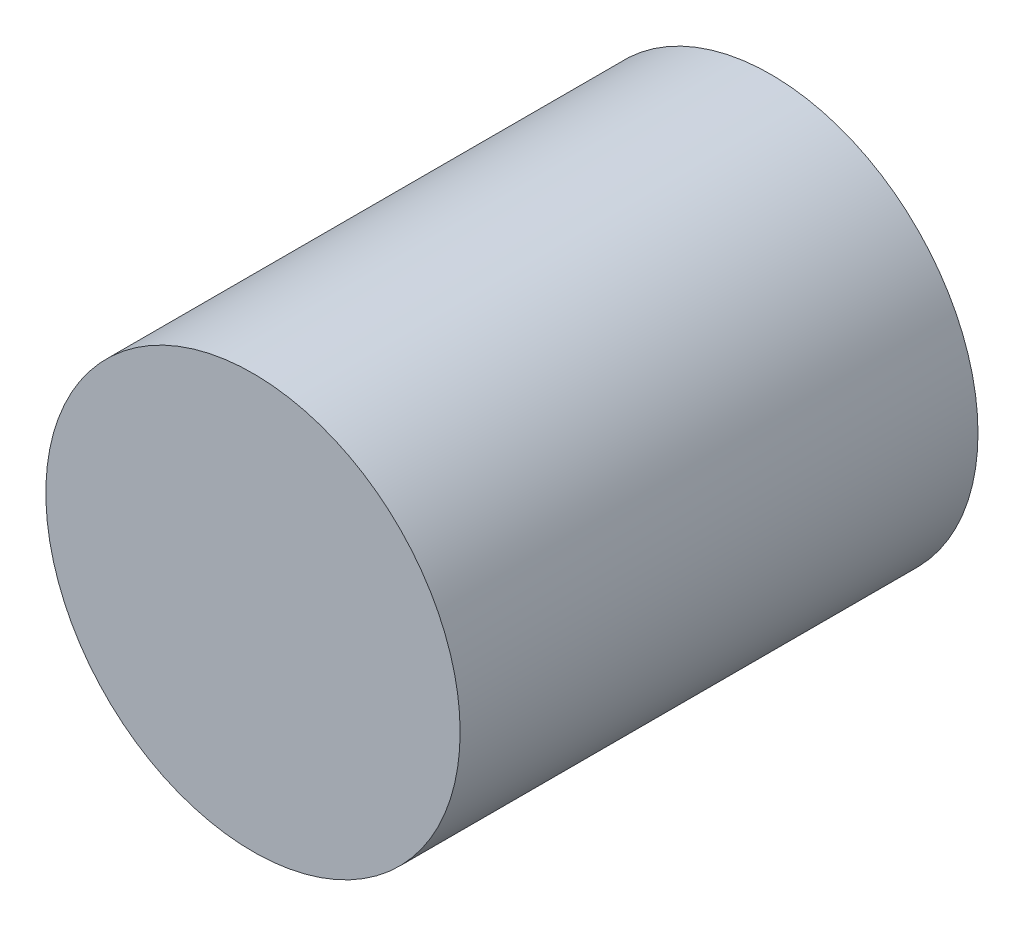
ISO-10303-21;
HEADER;
FILE_DESCRIPTION(('STEP AP214'),'2;1');
FILE_NAME('part.step','',(''),(''),'','','');
FILE_SCHEMA(('AUTOMOTIVE_DESIGN { 1 0 10303 214 1 1 1 1 }'));
ENDSEC;
DATA;
#1=APPLICATION_CONTEXT('core data for automotive mechanical design processes');
#2=APPLICATION_PROTOCOL_DEFINITION('international standard','automotive_design',2000,#1);
#3=PRODUCT_CONTEXT('',#1,'mechanical');
#4=PRODUCT('Part','Part','',(#3));
#5=PRODUCT_RELATED_PRODUCT_CATEGORY('part','',(#4));
#6=PRODUCT_DEFINITION_FORMATION('','',#4);
#7=PRODUCT_DEFINITION_CONTEXT('part definition',#1,'design');
#8=PRODUCT_DEFINITION('design','',#6,#7);
#9=PRODUCT_DEFINITION_SHAPE('','',#8);
#10=(LENGTH_UNIT() NAMED_UNIT(*) SI_UNIT(.MILLI.,.METRE.));
#11=(NAMED_UNIT(*) PLANE_ANGLE_UNIT() SI_UNIT($,.RADIAN.));
#12=(NAMED_UNIT(*) SI_UNIT($,.STERADIAN.) SOLID_ANGLE_UNIT());
#13=UNCERTAINTY_MEASURE_WITH_UNIT(LENGTH_MEASURE(1.E-05),#10,'distance_accuracy_value','');
#14=(GEOMETRIC_REPRESENTATION_CONTEXT(3) GLOBAL_UNCERTAINTY_ASSIGNED_CONTEXT((#13)) GLOBAL_UNIT_ASSIGNED_CONTEXT((#10,
#11,#12)) REPRESENTATION_CONTEXT('',''));
#15=CARTESIAN_POINT('',(0.,0.,0.));
#16=DIRECTION('',(0.,0.,1.));
#17=DIRECTION('',(1.,0.,0.));
#18=AXIS2_PLACEMENT_3D('',#15,#16,#17);
#19=CARTESIAN_POINT('',(0.,0.,50.));
#20=DIRECTION('',(0.,0.,-1.));
#21=DIRECTION('',(-1.,0.,0.));
#22=AXIS2_PLACEMENT_3D('',#19,#20,#21);
#23=CYLINDRICAL_SURFACE('',#22,20.);
#24=CARTESIAN_POINT('',(0.,0.,50.));
#25=DIRECTION('',(0.,0.,1.));
#26=DIRECTION('',(1.,0.,0.));
#27=AXIS2_PLACEMENT_3D('',#24,#25,#26);
#28=CIRCLE('',#27,20.);
#29=CARTESIAN_POINT('',(20.,0.,50.));
#30=VERTEX_POINT('',#29);
#31=EDGE_CURVE('E10',#30,#30,#28,.T.);
#32=ORIENTED_EDGE('',*,*,#31,.F.);
#33=EDGE_LOOP('',(#32));
#34=FACE_BOUND('',#33,.T.);
#35=CARTESIAN_POINT('',(0.,0.,0.));
#36=DIRECTION('',(0.,0.,1.));
#37=DIRECTION('',(1.,0.,0.));
#38=AXIS2_PLACEMENT_3D('',#35,#36,#37);
#39=CIRCLE('',#38,20.);
#40=CARTESIAN_POINT('',(20.,0.,0.));
#41=VERTEX_POINT('',#40);
#42=EDGE_CURVE('E34',#41,#41,#39,.T.);
#43=ORIENTED_EDGE('',*,*,#42,.T.);
#44=EDGE_LOOP('',(#43));
#45=FACE_BOUND('',#44,.T.);
#46=ADVANCED_FACE('F31',(#34,#45),#23,.T.);
#47=CARTESIAN_POINT('',(0.,0.,50.));
#48=DIRECTION('',(0.,0.,1.));
#49=DIRECTION('',(1.,0.,0.));
#50=AXIS2_PLACEMENT_3D('',#47,#48,#49);
#51=PLANE('',#50);
#52=ORIENTED_EDGE('',*,*,#31,.T.);
#53=EDGE_LOOP('',(#52));
#54=FACE_BOUND('',#53,.T.);
#55=ADVANCED_FACE('F46',(#54),#51,.T.);
#56=CARTESIAN_POINT('',(0.,0.,0.));
#57=DIRECTION('',(0.,0.,1.));
#58=DIRECTION('',(1.,0.,0.));
#59=AXIS2_PLACEMENT_3D('',#56,#57,#58);
#60=PLANE('',#59);
#61=ORIENTED_EDGE('',*,*,#42,.F.);
#62=EDGE_LOOP('',(#61));
#63=FACE_BOUND('',#62,.T.);
#64=ADVANCED_FACE('F44',(#63),#60,.F.);
#65=CLOSED_SHELL('',(#46,#55,#64));
#66=MANIFOLD_SOLID_BREP('B2',#65);
#67=ADVANCED_BREP_SHAPE_REPRESENTATION('',(#18,#66),#14);
#68=SHAPE_DEFINITION_REPRESENTATION(#9,#67);
ENDSEC;
END-ISO-10303-21;
